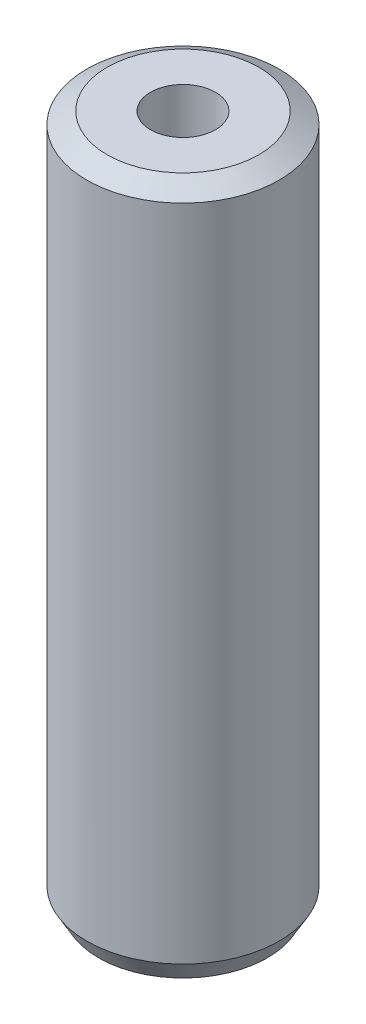
ISO-10303-21;
HEADER;
FILE_DESCRIPTION(('STEP AP214'),'2;1');
FILE_NAME('part.step','',(''),(''),'','','');
FILE_SCHEMA(('AUTOMOTIVE_DESIGN { 1 0 10303 214 1 1 1 1 }'));
ENDSEC;
DATA;
#1=APPLICATION_CONTEXT('core data for automotive mechanical design processes');
#2=APPLICATION_PROTOCOL_DEFINITION('international standard','automotive_design',2000,#1);
#3=PRODUCT_CONTEXT('',#1,'mechanical');
#4=PRODUCT('Part','Part','',(#3));
#5=PRODUCT_RELATED_PRODUCT_CATEGORY('part','',(#4));
#6=PRODUCT_DEFINITION_FORMATION('','',#4);
#7=PRODUCT_DEFINITION_CONTEXT('part definition',#1,'design');
#8=PRODUCT_DEFINITION('design','',#6,#7);
#9=PRODUCT_DEFINITION_SHAPE('','',#8);
#10=(LENGTH_UNIT() NAMED_UNIT(*) SI_UNIT(.MILLI.,.METRE.));
#11=(NAMED_UNIT(*) PLANE_ANGLE_UNIT() SI_UNIT($,.RADIAN.));
#12=(NAMED_UNIT(*) SI_UNIT($,.STERADIAN.) SOLID_ANGLE_UNIT());
#13=UNCERTAINTY_MEASURE_WITH_UNIT(LENGTH_MEASURE(1.E-05),#10,'distance_accuracy_value','');
#14=(GEOMETRIC_REPRESENTATION_CONTEXT(3) GLOBAL_UNCERTAINTY_ASSIGNED_CONTEXT((#13)) GLOBAL_UNIT_ASSIGNED_CONTEXT((#10,
#11,#12)) REPRESENTATION_CONTEXT('',''));
#15=CARTESIAN_POINT('',(0.,0.,0.));
#16=DIRECTION('',(0.,0.,1.));
#17=DIRECTION('',(1.,0.,0.));
#18=AXIS2_PLACEMENT_3D('',#15,#16,#17);
#19=CARTESIAN_POINT('',(0.,341.145152006258,0.));
#20=DIRECTION('',(0.,-1.,0.));
#21=DIRECTION('',(0.,0.,-1.));
#22=AXIS2_PLACEMENT_3D('',#19,#20,#21);
#23=CYLINDRICAL_SURFACE('',#22,47.5);
#24=CARTESIAN_POINT('',(0.,335.337762046146,0.));
#25=DIRECTION('',(0.,1.,0.));
#26=DIRECTION('',(0.,0.,1.));
#27=AXIS2_PLACEMENT_3D('',#24,#25,#26);
#28=CIRCLE('',#27,47.5);
#29=CARTESIAN_POINT('',(0.,335.337762046146,-47.5));
#30=VERTEX_POINT('',#29);
#31=EDGE_CURVE('E50',#30,#30,#28,.F.);
#32=CARTESIAN_POINT('',(0.,10.0586944702809,0.));
#33=DIRECTION('',(0.,1.,0.));
#34=DIRECTION('',(0.,0.,1.));
#35=AXIS2_PLACEMENT_3D('',#32,#33,#34);
#36=CIRCLE('',#35,47.5);
#37=CARTESIAN_POINT('',(0.,10.0586944702809,-47.5));
#38=VERTEX_POINT('',#37);
#39=EDGE_CURVE('E51',#38,#38,#36,.T.);
#40=CARTESIAN_POINT('',(0.,335.337762046146,-47.5));
#41=CARTESIAN_POINT('',(0.,331.949438425564,-47.5));
#42=CARTESIAN_POINT('',(0.,328.561114804982,-47.5));
#43=CARTESIAN_POINT('',(0.,321.784467563818,-47.5));
#44=CARTESIAN_POINT('',(0.,318.396143943236,-47.5));
#45=CARTESIAN_POINT('',(0.,311.619496702072,-47.5));
#46=CARTESIAN_POINT('',(0.,308.23117308149,-47.5));
#47=CARTESIAN_POINT('',(0.,301.454525840326,-47.5));
#48=CARTESIAN_POINT('',(0.,298.066202219744,-47.5));
#49=CARTESIAN_POINT('',(0.,291.289554978581,-47.5));
#50=CARTESIAN_POINT('',(0.,287.901231357999,-47.5));
#51=CARTESIAN_POINT('',(0.,281.124584116835,-47.5));
#52=CARTESIAN_POINT('',(0.,277.736260496253,-47.5));
#53=CARTESIAN_POINT('',(0.,270.959613255089,-47.5));
#54=CARTESIAN_POINT('',(0.,267.571289634507,-47.5));
#55=CARTESIAN_POINT('',(0.,260.794642393343,-47.5));
#56=CARTESIAN_POINT('',(0.,257.406318772761,-47.5));
#57=CARTESIAN_POINT('',(0.,250.629671531597,-47.5));
#58=CARTESIAN_POINT('',(0.,247.241347911016,-47.5));
#59=CARTESIAN_POINT('',(0.,240.464700669852,-47.5));
#60=CARTESIAN_POINT('',(0.,237.07637704927,-47.5));
#61=CARTESIAN_POINT('',(0.,230.299729808106,-47.5));
#62=CARTESIAN_POINT('',(0.,226.911406187524,-47.5));
#63=CARTESIAN_POINT('',(0.,220.13475894636,-47.5));
#64=CARTESIAN_POINT('',(0.,216.746435325778,-47.5));
#65=CARTESIAN_POINT('',(0.,209.969788084614,-47.5));
#66=CARTESIAN_POINT('',(0.,206.581464464032,-47.5));
#67=CARTESIAN_POINT('',(0.,199.804817222869,-47.5));
#68=CARTESIAN_POINT('',(0.,196.416493602287,-47.5));
#69=CARTESIAN_POINT('',(0.,189.639846361123,-47.5));
#70=CARTESIAN_POINT('',(0.,186.251522740541,-47.5));
#71=CARTESIAN_POINT('',(0.,179.474875499377,-47.5));
#72=CARTESIAN_POINT('',(0.,176.086551878795,-47.5));
#73=CARTESIAN_POINT('',(0.,169.309904637631,-47.5));
#74=CARTESIAN_POINT('',(0.,165.921581017049,-47.5));
#75=CARTESIAN_POINT('',(0.,159.144933775886,-47.5));
#76=CARTESIAN_POINT('',(0.,155.756610155304,-47.5));
#77=CARTESIAN_POINT('',(0.,148.97996291414,-47.5));
#78=CARTESIAN_POINT('',(0.,145.591639293558,-47.5));
#79=CARTESIAN_POINT('',(0.,138.814992052394,-47.5));
#80=CARTESIAN_POINT('',(0.,135.426668431812,-47.5));
#81=CARTESIAN_POINT('',(0.,128.650021190648,-47.5));
#82=CARTESIAN_POINT('',(0.,125.261697570066,-47.5));
#83=CARTESIAN_POINT('',(0.,118.485050328902,-47.5));
#84=CARTESIAN_POINT('',(0.,115.096726708321,-47.5));
#85=CARTESIAN_POINT('',(0.,108.320079467157,-47.5));
#86=CARTESIAN_POINT('',(0.,104.931755846575,-47.5));
#87=CARTESIAN_POINT('',(0.,98.1551086054109,-47.5));
#88=CARTESIAN_POINT('',(0.,94.766784984829,-47.5));
#89=CARTESIAN_POINT('',(0.,87.9901377436652,-47.5));
#90=CARTESIAN_POINT('',(0.,84.6018141230832,-47.5));
#91=CARTESIAN_POINT('',(0.,77.8251668819194,-47.5));
#92=CARTESIAN_POINT('',(0.,74.4368432613375,-47.5));
#93=CARTESIAN_POINT('',(0.,67.6601960201736,-47.5));
#94=CARTESIAN_POINT('',(0.,64.2718723995917,-47.5));
#95=CARTESIAN_POINT('',(0.,57.4952251584278,-47.5));
#96=CARTESIAN_POINT('',(0.,54.1069015378459,-47.5));
#97=CARTESIAN_POINT('',(0.,47.3302542966821,-47.5));
#98=CARTESIAN_POINT('',(0.,43.9419306761001,-47.5));
#99=CARTESIAN_POINT('',(0.,37.1652834349363,-47.5));
#100=CARTESIAN_POINT('',(0.,33.7769598143544,-47.5));
#101=CARTESIAN_POINT('',(0.,27.0003125731906,-47.5));
#102=CARTESIAN_POINT('',(0.,23.6119889526086,-47.5));
#103=CARTESIAN_POINT('',(0.,16.8353417114448,-47.5));
#104=CARTESIAN_POINT('',(0.,13.4470180908629,-47.5));
#105=CARTESIAN_POINT('',(0.,10.0586944702809,-47.5));
#106=B_SPLINE_CURVE_WITH_KNOTS('',3,(#40,#41,#42,#43,#44,#45,#46,#47,#48,#49,#50,#51,#52,#53,
#54,#55,#56,#57,#58,#59,#60,#61,#62,#63,#64,#65,#66,#67,#68,#69,#70,#71,#72,#73,#74,#75,#76,#77,
#78,#79,#80,#81,#82,#83,#84,#85,#86,#87,#88,#89,#90,#91,#92,#93,#94,#95,#96,#97,#98,#99,#100,
#101,#102,#103,#104,#105),.UNSPECIFIED.,.F.,.F.,(4,2,2,2,2,2,2,2,2,2,2,2,2,2,2,2,2,2,2,2,2,2,2,
2,2,2,2,2,2,2,2,2,4),(0.,10.1649708617458,20.3299417234916,30.4949125852373,40.6598834469831,
50.8248543087289,60.9898251704746,71.1547960322204,81.3197668939662,91.4847377557119,
101.649708617458,111.814679479203,121.979650340949,132.144621202695,142.309592064441,
152.474562926187,162.639533787932,172.804504649678,182.969475511424,193.13444637317,
203.299417234915,213.464388096661,223.629358958407,233.794329820153,243.959300681898,
254.124271543644,264.28924240539,274.454213267136,284.619184128882,294.784154990627,
304.949125852373,315.114096714119,325.279067575865),.UNSPECIFIED.);
#107=EDGE_CURVE('BSEAM39',#30,#38,#106,.T.);
#108=ORIENTED_EDGE('',*,*,#31,.T.);
#109=ORIENTED_EDGE('',*,*,#39,.T.);
#110=ORIENTED_EDGE('',*,*,#107,.T.);
#111=ORIENTED_EDGE('',*,*,#107,.F.);
#112=EDGE_LOOP('',(#108,#110,#109,#111));
#113=FACE_BOUND('',#112,.T.);
#114=ADVANCED_FACE('F39',(#113),#23,.T.);
#115=CARTESIAN_POINT('',(0.,341.145152006258,0.));
#116=DIRECTION('',(0.,1.,0.));
#117=DIRECTION('',(0.,0.,1.));
#118=AXIS2_PLACEMENT_3D('',#115,#116,#117);
#119=PLANE('',#118);
#120=CARTESIAN_POINT('',(0.,341.145152006258,0.));
#121=DIRECTION('',(0.,1.,0.));
#122=DIRECTION('',(0.,0.,1.));
#123=AXIS2_PLACEMENT_3D('',#120,#121,#122);
#124=CIRCLE('',#123,37.4413055297197);
#125=CARTESIAN_POINT('',(0.,341.145152006258,37.4413055297197));
#126=VERTEX_POINT('',#125);
#127=EDGE_CURVE('E54',#126,#126,#124,.T.);
#128=ORIENTED_EDGE('',*,*,#127,.T.);
#129=EDGE_LOOP('',(#128));
#130=FACE_BOUND('',#129,.T.);
#131=CARTESIAN_POINT('',(0.,341.145152006258,0.));
#132=DIRECTION('',(0.,1.,0.));
#133=DIRECTION('',(0.,0.,1.));
#134=AXIS2_PLACEMENT_3D('',#131,#132,#133);
#135=CIRCLE('',#134,16.0529642588585);
#136=CARTESIAN_POINT('',(0.,341.145152006258,-16.0529642588585));
#137=VERTEX_POINT('',#136);
#138=EDGE_CURVE('E58',#137,#137,#135,.T.);
#139=ORIENTED_EDGE('',*,*,#138,.F.);
#140=EDGE_LOOP('',(#139));
#141=FACE_BOUND('',#140,.T.);
#142=ADVANCED_FACE('F69',(#130,#141),#119,.T.);
#143=CARTESIAN_POINT('',(0.,0.,0.));
#144=DIRECTION('',(0.,1.,0.));
#145=DIRECTION('',(0.,0.,1.));
#146=AXIS2_PLACEMENT_3D('',#143,#144,#145);
#147=PLANE('',#146);
#148=CARTESIAN_POINT('',(0.,0.,0.));
#149=DIRECTION('',(0.,1.,0.));
#150=DIRECTION('',(0.,0.,1.));
#151=AXIS2_PLACEMENT_3D('',#148,#149,#150);
#152=CIRCLE('',#151,41.6926100398871);
#153=CARTESIAN_POINT('',(0.,0.,41.6926100398871));
#154=VERTEX_POINT('',#153);
#155=EDGE_CURVE('E10',#154,#154,#152,.F.);
#156=ORIENTED_EDGE('',*,*,#155,.T.);
#157=EDGE_LOOP('',(#156));
#158=FACE_BOUND('',#157,.T.);
#159=CARTESIAN_POINT('',(0.,0.,0.));
#160=DIRECTION('',(0.,1.,0.));
#161=DIRECTION('',(0.,0.,1.));
#162=AXIS2_PLACEMENT_3D('',#159,#160,#161);
#163=CIRCLE('',#162,16.0529642588585);
#164=CARTESIAN_POINT('',(0.,0.,-16.0529642588585));
#165=VERTEX_POINT('',#164);
#166=EDGE_CURVE('E63',#165,#165,#163,.T.);
#167=ORIENTED_EDGE('',*,*,#166,.T.);
#168=EDGE_LOOP('',(#167));
#169=FACE_BOUND('',#168,.T.);
#170=ADVANCED_FACE('F75',(#158,#169),#147,.F.);
#171=CARTESIAN_POINT('',(0.,341.145152006258,0.));
#172=DIRECTION('',(0.,-1.,0.));
#173=DIRECTION('',(0.,0.,-1.));
#174=AXIS2_PLACEMENT_3D('',#171,#172,#173);
#175=CYLINDRICAL_SURFACE('',#174,16.0529642588585);
#176=CARTESIAN_POINT('',(0.,341.145152006258,-16.0529642588585));
#177=CARTESIAN_POINT('',(0.,337.59155667286,-16.0529642588585));
#178=CARTESIAN_POINT('',(0.,334.037961339461,-16.0529642588585));
#179=CARTESIAN_POINT('',(0.,326.930770672664,-16.0529642588585));
#180=CARTESIAN_POINT('',(0.,323.377175339266,-16.0529642588585));
#181=CARTESIAN_POINT('',(0.,316.269984672468,-16.0529642588585));
#182=CARTESIAN_POINT('',(0.,312.71638933907,-16.0529642588585));
#183=CARTESIAN_POINT('',(0.,305.609198672273,-16.0529642588585));
#184=CARTESIAN_POINT('',(0.,302.055603338874,-16.0529642588585));
#185=CARTESIAN_POINT('',(0.,294.948412672077,-16.0529642588585));
#186=CARTESIAN_POINT('',(0.,291.394817338679,-16.0529642588585));
#187=CARTESIAN_POINT('',(0.,284.287626671882,-16.0529642588585));
#188=CARTESIAN_POINT('',(0.,280.734031338483,-16.0529642588585));
#189=CARTESIAN_POINT('',(0.,273.626840671686,-16.0529642588585));
#190=CARTESIAN_POINT('',(0.,270.073245338288,-16.0529642588585));
#191=CARTESIAN_POINT('',(0.,262.966054671491,-16.0529642588585));
#192=CARTESIAN_POINT('',(0.,259.412459338092,-16.0529642588585));
#193=CARTESIAN_POINT('',(0.,252.305268671295,-16.0529642588585));
#194=CARTESIAN_POINT('',(0.,248.751673337897,-16.0529642588585));
#195=CARTESIAN_POINT('',(0.,241.644482671099,-16.0529642588585));
#196=CARTESIAN_POINT('',(0.,238.090887337701,-16.0529642588585));
#197=CARTESIAN_POINT('',(0.,230.983696670904,-16.0529642588585));
#198=CARTESIAN_POINT('',(0.,227.430101337505,-16.0529642588585));
#199=CARTESIAN_POINT('',(0.,220.322910670708,-16.0529642588585));
#200=CARTESIAN_POINT('',(0.,216.76931533731,-16.0529642588585));
#201=CARTESIAN_POINT('',(0.,209.662124670513,-16.0529642588585));
#202=CARTESIAN_POINT('',(0.,206.108529337114,-16.0529642588585));
#203=CARTESIAN_POINT('',(0.,199.001338670317,-16.0529642588585));
#204=CARTESIAN_POINT('',(0.,195.447743336919,-16.0529642588585));
#205=CARTESIAN_POINT('',(0.,188.340552670122,-16.0529642588585));
#206=CARTESIAN_POINT('',(0.,184.786957336723,-16.0529642588585));
#207=CARTESIAN_POINT('',(0.,177.679766669926,-16.0529642588585));
#208=CARTESIAN_POINT('',(0.,174.126171336528,-16.0529642588585));
#209=CARTESIAN_POINT('',(0.,167.018980669731,-16.0529642588585));
#210=CARTESIAN_POINT('',(0.,163.465385336332,-16.0529642588585));
#211=CARTESIAN_POINT('',(0.,156.358194669535,-16.0529642588585));
#212=CARTESIAN_POINT('',(0.,152.804599336136,-16.0529642588585));
#213=CARTESIAN_POINT('',(0.,145.697408669339,-16.0529642588585));
#214=CARTESIAN_POINT('',(0.,142.143813335941,-16.0529642588585));
#215=CARTESIAN_POINT('',(0.,135.036622669144,-16.0529642588585));
#216=CARTESIAN_POINT('',(0.,131.483027335745,-16.0529642588585));
#217=CARTESIAN_POINT('',(0.,124.375836668948,-16.0529642588585));
#218=CARTESIAN_POINT('',(0.,120.82224133555,-16.0529642588585));
#219=CARTESIAN_POINT('',(0.,113.715050668753,-16.0529642588585));
#220=CARTESIAN_POINT('',(0.,110.161455335354,-16.0529642588585));
#221=CARTESIAN_POINT('',(0.,103.054264668557,-16.0529642588585));
#222=CARTESIAN_POINT('',(0.,99.5006693351586,-16.0529642588585));
#223=CARTESIAN_POINT('',(0.,92.3934786683616,-16.0529642588585));
#224=CARTESIAN_POINT('',(0.,88.839883334963,-16.0529642588585));
#225=CARTESIAN_POINT('',(0.,81.732692668166,-16.0529642588585));
#226=CARTESIAN_POINT('',(0.,78.1790973347674,-16.0529642588585));
#227=CARTESIAN_POINT('',(0.,71.0719066679704,-16.0529642588585));
#228=CARTESIAN_POINT('',(0.,67.5183113345719,-16.0529642588585));
#229=CARTESIAN_POINT('',(0.,60.4111206677748,-16.0529642588585));
#230=CARTESIAN_POINT('',(0.,56.8575253343763,-16.0529642588585));
#231=CARTESIAN_POINT('',(0.,49.7503346675793,-16.0529642588585));
#232=CARTESIAN_POINT('',(0.,46.1967393341807,-16.0529642588585));
#233=CARTESIAN_POINT('',(0.,39.0895486673837,-16.0529642588585));
#234=CARTESIAN_POINT('',(0.,35.5359533339852,-16.0529642588585));
#235=CARTESIAN_POINT('',(0.,28.4287626671881,-16.0529642588585));
#236=CARTESIAN_POINT('',(0.,24.8751673337896,-16.0529642588585));
#237=CARTESIAN_POINT('',(0.,17.7679766669926,-16.0529642588585));
#238=CARTESIAN_POINT('',(0.,14.214381333594,-16.0529642588585));
#239=CARTESIAN_POINT('',(0.,7.10719066679697,-16.0529642588585));
#240=CARTESIAN_POINT('',(0.,3.55359533339845,-16.0529642588585));
#241=CARTESIAN_POINT('',(0.,0.,-16.0529642588585));
#242=B_SPLINE_CURVE_WITH_KNOTS('',3,(#176,#177,#178,#179,#180,#181,#182,#183,#184,#185,#186,
#187,#188,#189,#190,#191,#192,#193,#194,#195,#196,#197,#198,#199,#200,#201,#202,#203,#204,#205,
#206,#207,#208,#209,#210,#211,#212,#213,#214,#215,#216,#217,#218,#219,#220,#221,#222,#223,#224,
#225,#226,#227,#228,#229,#230,#231,#232,#233,#234,#235,#236,#237,#238,#239,#240,#241),
.UNSPECIFIED.,.F.,.F.,(4,2,2,2,2,2,2,2,2,2,2,2,2,2,2,2,2,2,2,2,2,2,2,2,2,2,2,2,2,2,2,2,4),(0.,
10.6607860001955,21.3215720003911,31.9823580005867,42.6431440007822,53.3039300009778,
63.9647160011734,74.6255020013689,85.2862880015645,95.9470740017601,106.607860001956,
117.268646002151,127.929432002347,138.590218002542,149.251004002738,159.911790002933,
170.572576003129,181.233362003325,191.89414800352,202.554934003716,213.215720003911,
223.876506004107,234.537292004302,245.198078004498,255.858864004694,266.519650004889,
277.180436005085,287.84122200528,298.502008005476,309.162794005671,319.823580005867,
330.484366006063,341.145152006258),.UNSPECIFIED.);
#243=EDGE_CURVE('BSEAM70',#137,#165,#242,.T.);
#244=ORIENTED_EDGE('',*,*,#138,.T.);
#245=ORIENTED_EDGE('',*,*,#166,.F.);
#246=ORIENTED_EDGE('',*,*,#243,.T.);
#247=ORIENTED_EDGE('',*,*,#243,.F.);
#248=EDGE_LOOP('',(#244,#246,#245,#247));
#249=FACE_BOUND('',#248,.T.);
#250=ADVANCED_FACE('F70',(#249),#175,.F.);
#251=CARTESIAN_POINT('',(0.,341.145152006258,0.));
#252=DIRECTION('',(0.,-1.,0.));
#253=DIRECTION('',(0.,0.,-1.));
#254=AXIS2_PLACEMENT_3D('',#251,#252,#253);
#255=CONICAL_SURFACE('',#254,37.4413055297197,1.04719755119659);
#256=ORIENTED_EDGE('',*,*,#31,.F.);
#257=EDGE_LOOP('',(#256));
#258=FACE_BOUND('',#257,.T.);
#259=ORIENTED_EDGE('',*,*,#127,.F.);
#260=EDGE_LOOP('',(#259));
#261=FACE_BOUND('',#260,.T.);
#262=ADVANCED_FACE('F81',(#258,#261),#255,.T.);
#263=CARTESIAN_POINT('',(0.,10.0586944702809,0.));
#264=DIRECTION('',(0.,1.,0.));
#265=DIRECTION('',(0.,0.,1.));
#266=AXIS2_PLACEMENT_3D('',#263,#264,#265);
#267=CONICAL_SURFACE('',#266,47.5,0.523598775598303);
#268=ORIENTED_EDGE('',*,*,#155,.F.);
#269=EDGE_LOOP('',(#268));
#270=FACE_BOUND('',#269,.T.);
#271=ORIENTED_EDGE('',*,*,#39,.F.);
#272=EDGE_LOOP('',(#271));
#273=FACE_BOUND('',#272,.T.);
#274=ADVANCED_FACE('F45',(#270,#273),#267,.T.);
#275=CLOSED_SHELL('',(#114,#142,#170,#250,#262,#274));
#276=MANIFOLD_SOLID_BREP('B2',#275);
#277=ADVANCED_BREP_SHAPE_REPRESENTATION('',(#18,#276),#14);
#278=SHAPE_DEFINITION_REPRESENTATION(#9,#277);
ENDSEC;
END-ISO-10303-21;
